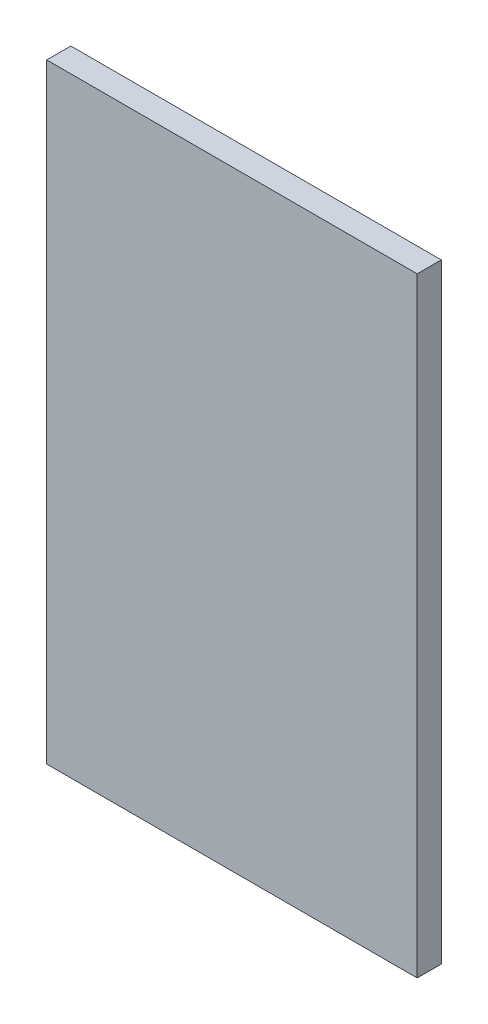
ISO-10303-21;
HEADER;
FILE_DESCRIPTION(('STEP AP214'),'2;1');
FILE_NAME('part.step','',(''),(''),'','','');
FILE_SCHEMA(('AUTOMOTIVE_DESIGN { 1 0 10303 214 1 1 1 1 }'));
ENDSEC;
DATA;
#1=APPLICATION_CONTEXT('core data for automotive mechanical design processes');
#2=APPLICATION_PROTOCOL_DEFINITION('international standard','automotive_design',2000,#1);
#3=PRODUCT_CONTEXT('',#1,'mechanical');
#4=PRODUCT('Part','Part','',(#3));
#5=PRODUCT_RELATED_PRODUCT_CATEGORY('part','',(#4));
#6=PRODUCT_DEFINITION_FORMATION('','',#4);
#7=PRODUCT_DEFINITION_CONTEXT('part definition',#1,'design');
#8=PRODUCT_DEFINITION('design','',#6,#7);
#9=PRODUCT_DEFINITION_SHAPE('','',#8);
#10=(LENGTH_UNIT() NAMED_UNIT(*) SI_UNIT(.MILLI.,.METRE.));
#11=(NAMED_UNIT(*) PLANE_ANGLE_UNIT() SI_UNIT($,.RADIAN.));
#12=(NAMED_UNIT(*) SI_UNIT($,.STERADIAN.) SOLID_ANGLE_UNIT());
#13=UNCERTAINTY_MEASURE_WITH_UNIT(LENGTH_MEASURE(1.E-05),#10,'distance_accuracy_value','');
#14=(GEOMETRIC_REPRESENTATION_CONTEXT(3) GLOBAL_UNCERTAINTY_ASSIGNED_CONTEXT((#13)) GLOBAL_UNIT_ASSIGNED_CONTEXT((#10,
#11,#12)) REPRESENTATION_CONTEXT('',''));
#15=CARTESIAN_POINT('',(0.,0.,0.));
#16=DIRECTION('',(0.,0.,1.));
#17=DIRECTION('',(1.,0.,0.));
#18=AXIS2_PLACEMENT_3D('',#15,#16,#17);
#19=CARTESIAN_POINT('',(-12310.709634714,20928.1551198859,-790.));
#20=DIRECTION('',(-1.,0.,0.));
#21=DIRECTION('',(0.,-1.,0.));
#22=AXIS2_PLACEMENT_3D('',#19,#20,#21);
#23=PLANE('',#22);
#24=DIRECTION('',(0.,0.,1.));
#25=VECTOR('',#24,1.);
#26=CARTESIAN_POINT('',(-12310.709634714,-19071.8448801141,-790.));
#27=LINE('',#26,#25);
#28=CARTESIAN_POINT('',(-12310.709634714,-19071.8448801141,-790.));
#29=VERTEX_POINT('',#28);
#30=CARTESIAN_POINT('',(-12310.709634714,-19071.8448801141,790.));
#31=VERTEX_POINT('',#30);
#32=EDGE_CURVE('E36',#29,#31,#27,.T.);
#33=ORIENTED_EDGE('',*,*,#32,.T.);
#34=DIRECTION('',(0.,-1.,0.));
#35=VECTOR('',#34,1.);
#36=CARTESIAN_POINT('',(-12310.709634714,20928.1551198859,790.));
#37=LINE('',#36,#35);
#38=CARTESIAN_POINT('',(-12310.709634714,20928.1551198859,790.));
#39=VERTEX_POINT('',#38);
#40=EDGE_CURVE('E73',#39,#31,#37,.T.);
#41=ORIENTED_EDGE('',*,*,#40,.F.);
#42=DIRECTION('',(0.,0.,1.));
#43=VECTOR('',#42,1.);
#44=CARTESIAN_POINT('',(-12310.709634714,20928.1551198859,-790.));
#45=LINE('',#44,#43);
#46=CARTESIAN_POINT('',(-12310.709634714,20928.1551198859,-790.));
#47=VERTEX_POINT('',#46);
#48=EDGE_CURVE('E11',#47,#39,#45,.T.);
#49=ORIENTED_EDGE('',*,*,#48,.F.);
#50=DIRECTION('',(0.,-1.,0.));
#51=VECTOR('',#50,1.);
#52=CARTESIAN_POINT('',(-12310.709634714,20928.1551198859,-790.));
#53=LINE('',#52,#51);
#54=EDGE_CURVE('E75',#47,#29,#53,.T.);
#55=ORIENTED_EDGE('',*,*,#54,.T.);
#56=EDGE_LOOP('',(#33,#41,#49,#55));
#57=FACE_BOUND('',#56,.T.);
#58=ADVANCED_FACE('F33',(#57),#23,.T.);
#59=CARTESIAN_POINT('',(-12310.709634714,20928.1551198859,-790.));
#60=DIRECTION('',(0.,-1.,0.));
#61=DIRECTION('',(0.,0.,-1.));
#62=AXIS2_PLACEMENT_3D('',#59,#60,#61);
#63=PLANE('',#62);
#64=ORIENTED_EDGE('',*,*,#48,.T.);
#65=DIRECTION('',(1.,0.,0.));
#66=VECTOR('',#65,1.);
#67=CARTESIAN_POINT('',(-12310.709634714,20928.1551198859,790.));
#68=LINE('',#67,#66);
#69=CARTESIAN_POINT('',(11989.290365286,20928.1551198859,790.));
#70=VERTEX_POINT('',#69);
#71=EDGE_CURVE('E91',#39,#70,#68,.T.);
#72=ORIENTED_EDGE('',*,*,#71,.T.);
#73=DIRECTION('',(0.,0.,1.));
#74=VECTOR('',#73,1.);
#75=CARTESIAN_POINT('',(11989.290365286,20928.1551198859,-790.));
#76=LINE('',#75,#74);
#77=CARTESIAN_POINT('',(11989.290365286,20928.1551198859,-790.));
#78=VERTEX_POINT('',#77);
#79=EDGE_CURVE('E41',#78,#70,#76,.T.);
#80=ORIENTED_EDGE('',*,*,#79,.F.);
#81=DIRECTION('',(1.,0.,0.));
#82=VECTOR('',#81,1.);
#83=CARTESIAN_POINT('',(-12310.709634714,20928.1551198859,-790.));
#84=LINE('',#83,#82);
#85=EDGE_CURVE('E54',#47,#78,#84,.T.);
#86=ORIENTED_EDGE('',*,*,#85,.F.);
#87=EDGE_LOOP('',(#64,#72,#80,#86));
#88=FACE_BOUND('',#87,.T.);
#89=ADVANCED_FACE('F106',(#88),#63,.F.);
#90=CARTESIAN_POINT('',(11989.290365286,20928.1551198859,-790.));
#91=DIRECTION('',(-1.,0.,0.));
#92=DIRECTION('',(0.,-1.,0.));
#93=AXIS2_PLACEMENT_3D('',#90,#91,#92);
#94=PLANE('',#93);
#95=ORIENTED_EDGE('',*,*,#79,.T.);
#96=DIRECTION('',(0.,-1.,0.));
#97=VECTOR('',#96,1.);
#98=CARTESIAN_POINT('',(11989.290365286,20928.1551198859,790.));
#99=LINE('',#98,#97);
#100=CARTESIAN_POINT('',(11989.290365286,-19071.8448801141,790.));
#101=VERTEX_POINT('',#100);
#102=EDGE_CURVE('E87',#70,#101,#99,.T.);
#103=ORIENTED_EDGE('',*,*,#102,.T.);
#104=DIRECTION('',(0.,0.,1.));
#105=VECTOR('',#104,1.);
#106=CARTESIAN_POINT('',(11989.290365286,-19071.8448801141,-790.));
#107=LINE('',#106,#105);
#108=CARTESIAN_POINT('',(11989.290365286,-19071.8448801141,-790.));
#109=VERTEX_POINT('',#108);
#110=EDGE_CURVE('E79',#109,#101,#107,.T.);
#111=ORIENTED_EDGE('',*,*,#110,.F.);
#112=DIRECTION('',(0.,-1.,0.));
#113=VECTOR('',#112,1.);
#114=CARTESIAN_POINT('',(11989.290365286,20928.1551198859,-790.));
#115=LINE('',#114,#113);
#116=EDGE_CURVE('E99',#78,#109,#115,.T.);
#117=ORIENTED_EDGE('',*,*,#116,.F.);
#118=EDGE_LOOP('',(#95,#103,#111,#117));
#119=FACE_BOUND('',#118,.T.);
#120=ADVANCED_FACE('F104',(#119),#94,.F.);
#121=CARTESIAN_POINT('',(-12310.709634714,-19071.8448801141,-790.));
#122=DIRECTION('',(0.,-1.,0.));
#123=DIRECTION('',(0.,0.,-1.));
#124=AXIS2_PLACEMENT_3D('',#121,#122,#123);
#125=PLANE('',#124);
#126=ORIENTED_EDGE('',*,*,#110,.T.);
#127=DIRECTION('',(1.,0.,0.));
#128=VECTOR('',#127,1.);
#129=CARTESIAN_POINT('',(-12310.709634714,-19071.8448801141,790.));
#130=LINE('',#129,#128);
#131=EDGE_CURVE('E81',#31,#101,#130,.T.);
#132=ORIENTED_EDGE('',*,*,#131,.F.);
#133=ORIENTED_EDGE('',*,*,#32,.F.);
#134=DIRECTION('',(1.,0.,0.));
#135=VECTOR('',#134,1.);
#136=CARTESIAN_POINT('',(-12310.709634714,-19071.8448801141,-790.));
#137=LINE('',#136,#135);
#138=EDGE_CURVE('E97',#29,#109,#137,.T.);
#139=ORIENTED_EDGE('',*,*,#138,.T.);
#140=EDGE_LOOP('',(#126,#132,#133,#139));
#141=FACE_BOUND('',#140,.T.);
#142=ADVANCED_FACE('F82',(#141),#125,.T.);
#143=CARTESIAN_POINT('',(0.,0.,-790.));
#144=DIRECTION('',(0.,0.,1.));
#145=DIRECTION('',(1.,0.,0.));
#146=AXIS2_PLACEMENT_3D('',#143,#144,#145);
#147=PLANE('',#146);
#148=ORIENTED_EDGE('',*,*,#54,.F.);
#149=ORIENTED_EDGE('',*,*,#85,.T.);
#150=ORIENTED_EDGE('',*,*,#116,.T.);
#151=ORIENTED_EDGE('',*,*,#138,.F.);
#152=EDGE_LOOP('',(#148,#149,#150,#151));
#153=FACE_BOUND('',#152,.T.);
#154=ADVANCED_FACE('F107',(#153),#147,.F.);
#155=CARTESIAN_POINT('',(0.,0.,790.));
#156=DIRECTION('',(0.,0.,1.));
#157=DIRECTION('',(1.,0.,0.));
#158=AXIS2_PLACEMENT_3D('',#155,#156,#157);
#159=PLANE('',#158);
#160=ORIENTED_EDGE('',*,*,#40,.T.);
#161=ORIENTED_EDGE('',*,*,#131,.T.);
#162=ORIENTED_EDGE('',*,*,#102,.F.);
#163=ORIENTED_EDGE('',*,*,#71,.F.);
#164=EDGE_LOOP('',(#160,#161,#162,#163));
#165=FACE_BOUND('',#164,.T.);
#166=ADVANCED_FACE('F89',(#165),#159,.T.);
#167=CLOSED_SHELL('',(#58,#89,#120,#142,#154,#166));
#168=MANIFOLD_SOLID_BREP('B2',#167);
#169=ADVANCED_BREP_SHAPE_REPRESENTATION('',(#18,#168),#14);
#170=SHAPE_DEFINITION_REPRESENTATION(#9,#169);
ENDSEC;
END-ISO-10303-21;
